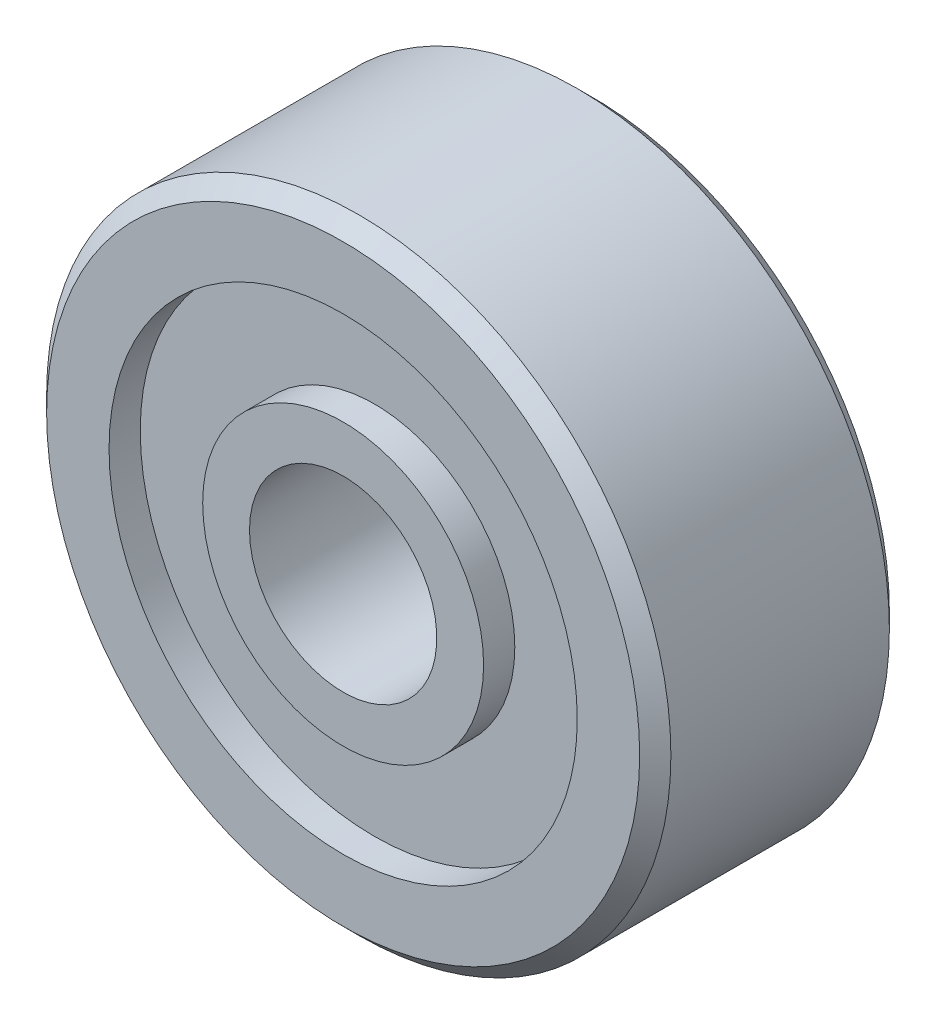
ISO-10303-21;
HEADER;
FILE_DESCRIPTION(('STEP AP214'),'2;1');
FILE_NAME('part.step','',(''),(''),'','','');
FILE_SCHEMA(('AUTOMOTIVE_DESIGN { 1 0 10303 214 1 1 1 1 }'));
ENDSEC;
DATA;
#1=APPLICATION_CONTEXT('core data for automotive mechanical design processes');
#2=APPLICATION_PROTOCOL_DEFINITION('international standard','automotive_design',2000,#1);
#3=PRODUCT_CONTEXT('',#1,'mechanical');
#4=PRODUCT('Part','Part','',(#3));
#5=PRODUCT_RELATED_PRODUCT_CATEGORY('part','',(#4));
#6=PRODUCT_DEFINITION_FORMATION('','',#4);
#7=PRODUCT_DEFINITION_CONTEXT('part definition',#1,'design');
#8=PRODUCT_DEFINITION('design','',#6,#7);
#9=PRODUCT_DEFINITION_SHAPE('','',#8);
#10=(LENGTH_UNIT() NAMED_UNIT(*) SI_UNIT(.MILLI.,.METRE.));
#11=(NAMED_UNIT(*) PLANE_ANGLE_UNIT() SI_UNIT($,.RADIAN.));
#12=(NAMED_UNIT(*) SI_UNIT($,.STERADIAN.) SOLID_ANGLE_UNIT());
#13=UNCERTAINTY_MEASURE_WITH_UNIT(LENGTH_MEASURE(1.E-05),#10,'distance_accuracy_value','');
#14=(GEOMETRIC_REPRESENTATION_CONTEXT(3) GLOBAL_UNCERTAINTY_ASSIGNED_CONTEXT((#13)) GLOBAL_UNIT_ASSIGNED_CONTEXT((#10,
#11,#12)) REPRESENTATION_CONTEXT('',''));
#15=CARTESIAN_POINT('',(0.,0.,0.));
#16=DIRECTION('',(0.,0.,1.));
#17=DIRECTION('',(1.,0.,0.));
#18=AXIS2_PLACEMENT_3D('',#15,#16,#17);
#19=CARTESIAN_POINT('',(1.5,0.,2.5));
#20=DIRECTION('',(0.,0.,-1.));
#21=DIRECTION('',(-1.,0.,0.));
#22=AXIS2_PLACEMENT_3D('',#19,#20,#21);
#23=CYLINDRICAL_SURFACE('',#22,5.);
#24=CARTESIAN_POINT('',(1.5,0.,1.25));
#25=DIRECTION('',(0.,0.,-1.));
#26=DIRECTION('',(-1.,0.,0.));
#27=AXIS2_PLACEMENT_3D('',#24,#25,#26);
#28=CIRCLE('',#27,5.);
#29=CARTESIAN_POINT('',(-3.5,0.,1.25));
#30=VERTEX_POINT('',#29);
#31=EDGE_CURVE('E10',#30,#30,#28,.T.);
#32=ORIENTED_EDGE('',*,*,#31,.T.);
#33=EDGE_LOOP('',(#32));
#34=FACE_BOUND('',#33,.T.);
#35=CARTESIAN_POINT('',(1.5,0.,-2.25));
#36=DIRECTION('',(0.,0.,-1.));
#37=DIRECTION('',(-1.,0.,0.));
#38=AXIS2_PLACEMENT_3D('',#35,#36,#37);
#39=CIRCLE('',#38,5.);
#40=CARTESIAN_POINT('',(-3.5,0.,-2.25));
#41=VERTEX_POINT('',#40);
#42=EDGE_CURVE('E75',#41,#41,#39,.T.);
#43=ORIENTED_EDGE('',*,*,#42,.F.);
#44=EDGE_LOOP('',(#43));
#45=FACE_BOUND('',#44,.T.);
#46=ADVANCED_FACE('F29',(#34,#45),#23,.T.);
#47=CARTESIAN_POINT('',(1.5,0.,1.25));
#48=DIRECTION('',(0.,0.,-1.));
#49=DIRECTION('',(-1.,0.,0.));
#50=AXIS2_PLACEMENT_3D('',#47,#48,#49);
#51=CONICAL_SURFACE('',#50,5.,0.785398163397459);
#52=CARTESIAN_POINT('',(1.5,0.,1.5));
#53=DIRECTION('',(0.,0.,-1.));
#54=DIRECTION('',(-1.,0.,0.));
#55=AXIS2_PLACEMENT_3D('',#52,#53,#54);
#56=CIRCLE('',#55,4.75);
#57=CARTESIAN_POINT('',(-3.25,0.,1.5));
#58=VERTEX_POINT('',#57);
#59=EDGE_CURVE('E35',#58,#58,#56,.T.);
#60=ORIENTED_EDGE('',*,*,#59,.T.);
#61=EDGE_LOOP('',(#60));
#62=FACE_BOUND('',#61,.T.);
#63=ORIENTED_EDGE('',*,*,#31,.F.);
#64=EDGE_LOOP('',(#63));
#65=FACE_BOUND('',#64,.T.);
#66=ADVANCED_FACE('F83',(#62,#65),#51,.T.);
#67=CARTESIAN_POINT('',(6.25,0.,1.5));
#68=DIRECTION('',(0.,0.,1.));
#69=DIRECTION('',(1.,0.,0.));
#70=AXIS2_PLACEMENT_3D('',#67,#68,#69);
#71=PLANE('',#70);
#72=CARTESIAN_POINT('',(1.5,0.,1.5));
#73=DIRECTION('',(0.,0.,-1.));
#74=DIRECTION('',(-1.,0.,0.));
#75=AXIS2_PLACEMENT_3D('',#72,#73,#74);
#76=CIRCLE('',#75,3.75);
#77=CARTESIAN_POINT('',(-2.25,0.,1.5));
#78=VERTEX_POINT('',#77);
#79=EDGE_CURVE('E39',#78,#78,#76,.T.);
#80=ORIENTED_EDGE('',*,*,#79,.T.);
#81=EDGE_LOOP('',(#80));
#82=FACE_BOUND('',#81,.T.);
#83=ORIENTED_EDGE('',*,*,#59,.F.);
#84=EDGE_LOOP('',(#83));
#85=FACE_BOUND('',#84,.T.);
#86=ADVANCED_FACE('F87',(#82,#85),#71,.T.);
#87=CARTESIAN_POINT('',(1.5,0.,2.5));
#88=DIRECTION('',(0.,0.,-1.));
#89=DIRECTION('',(-1.,0.,0.));
#90=AXIS2_PLACEMENT_3D('',#87,#88,#89);
#91=CYLINDRICAL_SURFACE('',#90,3.75);
#92=CARTESIAN_POINT('',(1.5,0.,1.));
#93=DIRECTION('',(0.,0.,-1.));
#94=DIRECTION('',(-1.,0.,0.));
#95=AXIS2_PLACEMENT_3D('',#92,#93,#94);
#96=CIRCLE('',#95,3.75);
#97=CARTESIAN_POINT('',(-2.25,0.,0.999999999999999));
#98=VERTEX_POINT('',#97);
#99=EDGE_CURVE('E43',#98,#98,#96,.T.);
#100=ORIENTED_EDGE('',*,*,#99,.T.);
#101=EDGE_LOOP('',(#100));
#102=FACE_BOUND('',#101,.T.);
#103=ORIENTED_EDGE('',*,*,#79,.F.);
#104=EDGE_LOOP('',(#103));
#105=FACE_BOUND('',#104,.T.);
#106=ADVANCED_FACE('F91',(#102,#105),#91,.F.);
#107=CARTESIAN_POINT('',(5.25,0.,1.));
#108=DIRECTION('',(0.,0.,1.));
#109=DIRECTION('',(1.,0.,0.));
#110=AXIS2_PLACEMENT_3D('',#107,#108,#109);
#111=PLANE('',#110);
#112=CARTESIAN_POINT('',(1.5,0.,0.999999999999999));
#113=DIRECTION('',(0.,0.,-1.));
#114=DIRECTION('',(-1.,0.,0.));
#115=AXIS2_PLACEMENT_3D('',#112,#113,#114);
#116=CIRCLE('',#115,2.25);
#117=CARTESIAN_POINT('',(-0.750000000000001,0.,0.999999999999999));
#118=VERTEX_POINT('',#117);
#119=EDGE_CURVE('E48',#118,#118,#116,.T.);
#120=ORIENTED_EDGE('',*,*,#119,.T.);
#121=EDGE_LOOP('',(#120));
#122=FACE_BOUND('',#121,.T.);
#123=ORIENTED_EDGE('',*,*,#99,.F.);
#124=EDGE_LOOP('',(#123));
#125=FACE_BOUND('',#124,.T.);
#126=ADVANCED_FACE('F98',(#122,#125),#111,.T.);
#127=CARTESIAN_POINT('',(1.5,0.,2.5));
#128=DIRECTION('',(0.,0.,-1.));
#129=DIRECTION('',(-1.,0.,0.));
#130=AXIS2_PLACEMENT_3D('',#127,#128,#129);
#131=CYLINDRICAL_SURFACE('',#130,2.25);
#132=CARTESIAN_POINT('',(1.5,0.,1.5));
#133=DIRECTION('',(0.,0.,-1.));
#134=DIRECTION('',(-1.,0.,0.));
#135=AXIS2_PLACEMENT_3D('',#132,#133,#134);
#136=CIRCLE('',#135,2.25);
#137=CARTESIAN_POINT('',(-0.750000000000001,0.,1.5));
#138=VERTEX_POINT('',#137);
#139=EDGE_CURVE('E51',#138,#138,#136,.T.);
#140=ORIENTED_EDGE('',*,*,#139,.T.);
#141=EDGE_LOOP('',(#140));
#142=FACE_BOUND('',#141,.T.);
#143=ORIENTED_EDGE('',*,*,#119,.F.);
#144=EDGE_LOOP('',(#143));
#145=FACE_BOUND('',#144,.T.);
#146=ADVANCED_FACE('F102',(#142,#145),#131,.T.);
#147=CARTESIAN_POINT('',(3.75,0.,1.5));
#148=DIRECTION('',(0.,0.,1.));
#149=DIRECTION('',(1.,0.,0.));
#150=AXIS2_PLACEMENT_3D('',#147,#148,#149);
#151=PLANE('',#150);
#152=CARTESIAN_POINT('',(1.5,0.,1.5));
#153=DIRECTION('',(0.,0.,-1.));
#154=DIRECTION('',(-1.,0.,0.));
#155=AXIS2_PLACEMENT_3D('',#152,#153,#154);
#156=CIRCLE('',#155,1.5);
#157=CARTESIAN_POINT('',(0.,0.,1.5));
#158=VERTEX_POINT('',#157);
#159=EDGE_CURVE('E54',#158,#158,#156,.T.);
#160=ORIENTED_EDGE('',*,*,#159,.T.);
#161=EDGE_LOOP('',(#160));
#162=FACE_BOUND('',#161,.T.);
#163=ORIENTED_EDGE('',*,*,#139,.F.);
#164=EDGE_LOOP('',(#163));
#165=FACE_BOUND('',#164,.T.);
#166=ADVANCED_FACE('F106',(#162,#165),#151,.T.);
#167=CARTESIAN_POINT('',(1.5,0.,2.5));
#168=DIRECTION('',(0.,0.,-1.));
#169=DIRECTION('',(-1.,0.,0.));
#170=AXIS2_PLACEMENT_3D('',#167,#168,#169);
#171=CYLINDRICAL_SURFACE('',#170,1.5);
#172=CARTESIAN_POINT('',(1.5,0.,-2.5));
#173=DIRECTION('',(0.,0.,-1.));
#174=DIRECTION('',(-1.,0.,0.));
#175=AXIS2_PLACEMENT_3D('',#172,#173,#174);
#176=CIRCLE('',#175,1.5);
#177=CARTESIAN_POINT('',(0.,0.,-2.5));
#178=VERTEX_POINT('',#177);
#179=EDGE_CURVE('E57',#178,#178,#176,.T.);
#180=ORIENTED_EDGE('',*,*,#179,.T.);
#181=EDGE_LOOP('',(#180));
#182=FACE_BOUND('',#181,.T.);
#183=ORIENTED_EDGE('',*,*,#159,.F.);
#184=EDGE_LOOP('',(#183));
#185=FACE_BOUND('',#184,.T.);
#186=ADVANCED_FACE('F110',(#182,#185),#171,.F.);
#187=CARTESIAN_POINT('',(3.,0.,-2.5));
#188=DIRECTION('',(0.,0.,-1.));
#189=DIRECTION('',(-1.,0.,0.));
#190=AXIS2_PLACEMENT_3D('',#187,#188,#189);
#191=PLANE('',#190);
#192=CARTESIAN_POINT('',(1.5,0.,-2.5));
#193=DIRECTION('',(0.,0.,-1.));
#194=DIRECTION('',(-1.,0.,0.));
#195=AXIS2_PLACEMENT_3D('',#192,#193,#194);
#196=CIRCLE('',#195,2.25);
#197=CARTESIAN_POINT('',(-0.749999999999998,0.,-2.5));
#198=VERTEX_POINT('',#197);
#199=EDGE_CURVE('E60',#198,#198,#196,.T.);
#200=ORIENTED_EDGE('',*,*,#199,.T.);
#201=EDGE_LOOP('',(#200));
#202=FACE_BOUND('',#201,.T.);
#203=ORIENTED_EDGE('',*,*,#179,.F.);
#204=EDGE_LOOP('',(#203));
#205=FACE_BOUND('',#204,.T.);
#206=ADVANCED_FACE('F114',(#202,#205),#191,.T.);
#207=CARTESIAN_POINT('',(1.5,0.,2.5));
#208=DIRECTION('',(0.,0.,-1.));
#209=DIRECTION('',(-1.,0.,0.));
#210=AXIS2_PLACEMENT_3D('',#207,#208,#209);
#211=CYLINDRICAL_SURFACE('',#210,2.25);
#212=CARTESIAN_POINT('',(1.5,0.,-2.));
#213=DIRECTION('',(0.,0.,-1.));
#214=DIRECTION('',(-1.,0.,0.));
#215=AXIS2_PLACEMENT_3D('',#212,#213,#214);
#216=CIRCLE('',#215,2.25);
#217=CARTESIAN_POINT('',(-0.749999999999998,0.,-2.));
#218=VERTEX_POINT('',#217);
#219=EDGE_CURVE('E63',#218,#218,#216,.T.);
#220=ORIENTED_EDGE('',*,*,#219,.T.);
#221=EDGE_LOOP('',(#220));
#222=FACE_BOUND('',#221,.T.);
#223=ORIENTED_EDGE('',*,*,#199,.F.);
#224=EDGE_LOOP('',(#223));
#225=FACE_BOUND('',#224,.T.);
#226=ADVANCED_FACE('F118',(#222,#225),#211,.T.);
#227=CARTESIAN_POINT('',(3.75,0.,-2.));
#228=DIRECTION('',(0.,0.,-1.));
#229=DIRECTION('',(-1.,0.,0.));
#230=AXIS2_PLACEMENT_3D('',#227,#228,#229);
#231=PLANE('',#230);
#232=CARTESIAN_POINT('',(1.5,0.,-2.));
#233=DIRECTION('',(0.,0.,-1.));
#234=DIRECTION('',(-1.,0.,0.));
#235=AXIS2_PLACEMENT_3D('',#232,#233,#234);
#236=CIRCLE('',#235,3.75);
#237=CARTESIAN_POINT('',(-2.25,0.,-2.));
#238=VERTEX_POINT('',#237);
#239=EDGE_CURVE('E66',#238,#238,#236,.T.);
#240=ORIENTED_EDGE('',*,*,#239,.T.);
#241=EDGE_LOOP('',(#240));
#242=FACE_BOUND('',#241,.T.);
#243=ORIENTED_EDGE('',*,*,#219,.F.);
#244=EDGE_LOOP('',(#243));
#245=FACE_BOUND('',#244,.T.);
#246=ADVANCED_FACE('F122',(#242,#245),#231,.T.);
#247=CARTESIAN_POINT('',(1.5,0.,2.5));
#248=DIRECTION('',(0.,0.,-1.));
#249=DIRECTION('',(-1.,0.,0.));
#250=AXIS2_PLACEMENT_3D('',#247,#248,#249);
#251=CYLINDRICAL_SURFACE('',#250,3.75);
#252=CARTESIAN_POINT('',(1.5,0.,-2.5));
#253=DIRECTION('',(0.,0.,-1.));
#254=DIRECTION('',(-1.,0.,0.));
#255=AXIS2_PLACEMENT_3D('',#252,#253,#254);
#256=CIRCLE('',#255,3.75);
#257=CARTESIAN_POINT('',(-2.25,0.,-2.5));
#258=VERTEX_POINT('',#257);
#259=EDGE_CURVE('E69',#258,#258,#256,.T.);
#260=ORIENTED_EDGE('',*,*,#259,.T.);
#261=EDGE_LOOP('',(#260));
#262=FACE_BOUND('',#261,.T.);
#263=ORIENTED_EDGE('',*,*,#239,.F.);
#264=EDGE_LOOP('',(#263));
#265=FACE_BOUND('',#264,.T.);
#266=ADVANCED_FACE('F126',(#262,#265),#251,.F.);
#267=CARTESIAN_POINT('',(5.25,0.,-2.5));
#268=DIRECTION('',(0.,0.,-1.));
#269=DIRECTION('',(-1.,0.,0.));
#270=AXIS2_PLACEMENT_3D('',#267,#268,#269);
#271=PLANE('',#270);
#272=CARTESIAN_POINT('',(1.5,0.,-2.5));
#273=DIRECTION('',(0.,0.,-1.));
#274=DIRECTION('',(-1.,0.,0.));
#275=AXIS2_PLACEMENT_3D('',#272,#273,#274);
#276=CIRCLE('',#275,4.75);
#277=CARTESIAN_POINT('',(-3.25,0.,-2.5));
#278=VERTEX_POINT('',#277);
#279=EDGE_CURVE('E72',#278,#278,#276,.T.);
#280=ORIENTED_EDGE('',*,*,#279,.T.);
#281=EDGE_LOOP('',(#280));
#282=FACE_BOUND('',#281,.T.);
#283=ORIENTED_EDGE('',*,*,#259,.F.);
#284=EDGE_LOOP('',(#283));
#285=FACE_BOUND('',#284,.T.);
#286=ADVANCED_FACE('F130',(#282,#285),#271,.T.);
#287=CARTESIAN_POINT('',(1.5,0.,-2.5));
#288=DIRECTION('',(0.,0.,1.));
#289=DIRECTION('',(1.,0.,0.));
#290=AXIS2_PLACEMENT_3D('',#287,#288,#289);
#291=CONICAL_SURFACE('',#290,4.75,0.785398163397453);
#292=ORIENTED_EDGE('',*,*,#42,.T.);
#293=EDGE_LOOP('',(#292));
#294=FACE_BOUND('',#293,.T.);
#295=ORIENTED_EDGE('',*,*,#279,.F.);
#296=EDGE_LOOP('',(#295));
#297=FACE_BOUND('',#296,.T.);
#298=ADVANCED_FACE('F79',(#294,#297),#291,.T.);
#299=CLOSED_SHELL('',(#46,#66,#86,#106,#126,#146,#166,#186,#206,#226,#246,#266,#286,#298));
#300=MANIFOLD_SOLID_BREP('B2',#299);
#301=ADVANCED_BREP_SHAPE_REPRESENTATION('',(#18,#300),#14);
#302=SHAPE_DEFINITION_REPRESENTATION(#9,#301);
ENDSEC;
END-ISO-10303-21;
